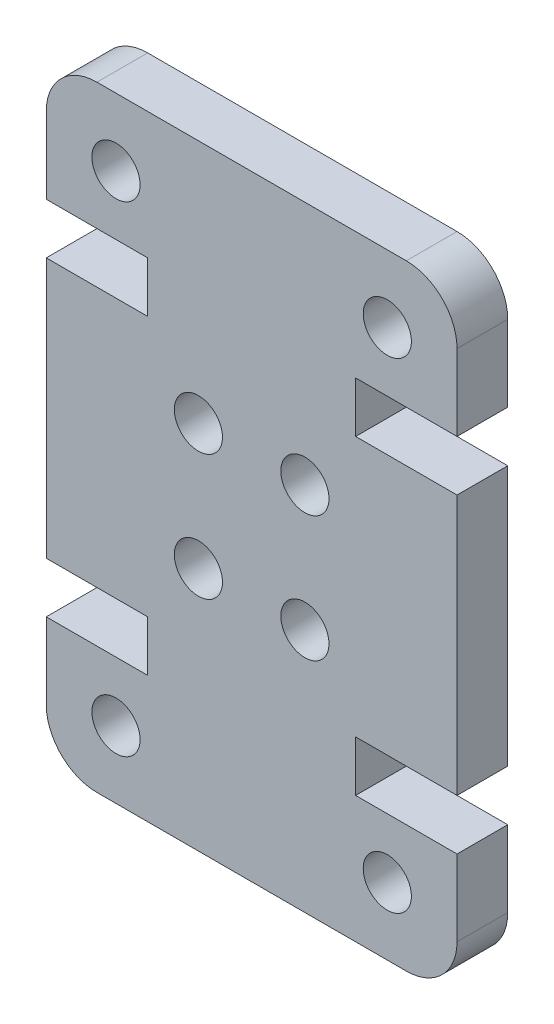
ISO-10303-21;
HEADER;
FILE_DESCRIPTION(('STEP AP214'),'2;1');
FILE_NAME('part.step','',(''),(''),'','','');
FILE_SCHEMA(('AUTOMOTIVE_DESIGN { 1 0 10303 214 1 1 1 1 }'));
ENDSEC;
DATA;
#1=APPLICATION_CONTEXT('core data for automotive mechanical design processes');
#2=APPLICATION_PROTOCOL_DEFINITION('international standard','automotive_design',2000,#1);
#3=PRODUCT_CONTEXT('',#1,'mechanical');
#4=PRODUCT('Part','Part','',(#3));
#5=PRODUCT_RELATED_PRODUCT_CATEGORY('part','',(#4));
#6=PRODUCT_DEFINITION_FORMATION('','',#4);
#7=PRODUCT_DEFINITION_CONTEXT('part definition',#1,'design');
#8=PRODUCT_DEFINITION('design','',#6,#7);
#9=PRODUCT_DEFINITION_SHAPE('','',#8);
#10=(LENGTH_UNIT() NAMED_UNIT(*) SI_UNIT(.MILLI.,.METRE.));
#11=(NAMED_UNIT(*) PLANE_ANGLE_UNIT() SI_UNIT($,.RADIAN.));
#12=(NAMED_UNIT(*) SI_UNIT($,.STERADIAN.) SOLID_ANGLE_UNIT());
#13=UNCERTAINTY_MEASURE_WITH_UNIT(LENGTH_MEASURE(1.E-05),#10,'distance_accuracy_value','');
#14=(GEOMETRIC_REPRESENTATION_CONTEXT(3) GLOBAL_UNCERTAINTY_ASSIGNED_CONTEXT((#13)) GLOBAL_UNIT_ASSIGNED_CONTEXT((#10,
#11,#12)) REPRESENTATION_CONTEXT('',''));
#15=CARTESIAN_POINT('',(0.,0.,0.));
#16=DIRECTION('',(0.,0.,1.));
#17=DIRECTION('',(1.,0.,0.));
#18=AXIS2_PLACEMENT_3D('',#15,#16,#17);
#19=CARTESIAN_POINT('',(14.2,2.,2.));
#20=DIRECTION('',(0.,0.,-1.));
#21=DIRECTION('',(-1.,0.,0.));
#22=AXIS2_PLACEMENT_3D('',#19,#20,#21);
#23=PLANE('',#22);
#24=CARTESIAN_POINT('',(6.00000000000001,9.65355116894447,2.));
#25=DIRECTION('',(0.,0.,1.));
#26=DIRECTION('',(1.,0.,0.));
#27=AXIS2_PLACEMENT_3D('',#24,#25,#26);
#28=CIRCLE('',#27,0.95);
#29=CARTESIAN_POINT('',(6.95,9.65355116894447,2.));
#30=VERTEX_POINT('',#29);
#31=EDGE_CURVE('E464',#30,#30,#28,.T.);
#32=ORIENTED_EDGE('',*,*,#31,.F.);
#33=EDGE_LOOP('',(#32));
#34=FACE_BOUND('',#33,.T.);
#35=CARTESIAN_POINT('',(10.2,14.6064488310555,2.));
#36=DIRECTION('',(0.,0.,1.));
#37=DIRECTION('',(1.,0.,0.));
#38=AXIS2_PLACEMENT_3D('',#35,#36,#37);
#39=CIRCLE('',#38,0.949999999999999);
#40=CARTESIAN_POINT('',(11.15,14.6064488310555,2.));
#41=VERTEX_POINT('',#40);
#42=EDGE_CURVE('E476',#41,#41,#39,.T.);
#43=ORIENTED_EDGE('',*,*,#42,.F.);
#44=EDGE_LOOP('',(#43));
#45=FACE_BOUND('',#44,.T.);
#46=CARTESIAN_POINT('',(2.75000000000003,21.606448831055,2.));
#47=DIRECTION('',(0.,0.,1.));
#48=DIRECTION('',(-1.,0.,0.));
#49=AXIS2_PLACEMENT_3D('',#46,#47,#48);
#50=CIRCLE('',#49,0.95);
#51=CARTESIAN_POINT('',(1.80000000000003,21.606448831055,2.));
#52=VERTEX_POINT('',#51);
#53=EDGE_CURVE('E488',#52,#52,#50,.T.);
#54=ORIENTED_EDGE('',*,*,#53,.F.);
#55=EDGE_LOOP('',(#54));
#56=FACE_BOUND('',#55,.T.);
#57=CARTESIAN_POINT('',(13.45,2.65355116894501,2.));
#58=DIRECTION('',(0.,0.,1.));
#59=DIRECTION('',(-1.,0.,0.));
#60=AXIS2_PLACEMENT_3D('',#57,#58,#59);
#61=CIRCLE('',#60,0.949999999999999);
#62=CARTESIAN_POINT('',(12.5,2.65355116894501,2.));
#63=VERTEX_POINT('',#62);
#64=EDGE_CURVE('E230',#63,#63,#61,.T.);
#65=ORIENTED_EDGE('',*,*,#64,.F.);
#66=EDGE_LOOP('',(#65));
#67=FACE_BOUND('',#66,.T.);
#68=CARTESIAN_POINT('',(14.2,2.,2.));
#69=DIRECTION('',(0.,0.,1.));
#70=DIRECTION('',(-1.,0.,0.));
#71=AXIS2_PLACEMENT_3D('',#68,#69,#70);
#72=CIRCLE('',#71,2.);
#73=CARTESIAN_POINT('',(14.2,0.,2.));
#74=VERTEX_POINT('',#73);
#75=CARTESIAN_POINT('',(16.2,2.,2.));
#76=VERTEX_POINT('',#75);
#77=EDGE_CURVE('E273',#74,#76,#72,.T.);
#78=ORIENTED_EDGE('',*,*,#77,.T.);
#79=DIRECTION('',(0.,1.,0.));
#80=VECTOR('',#79,1.);
#81=CARTESIAN_POINT('',(16.2,2.,2.));
#82=LINE('',#81,#80);
#83=CARTESIAN_POINT('',(16.2,4.99999999999945,2.));
#84=VERTEX_POINT('',#83);
#85=EDGE_CURVE('E141',#76,#84,#82,.T.);
#86=ORIENTED_EDGE('',*,*,#85,.T.);
#87=DIRECTION('',(-1.,0.,0.));
#88=VECTOR('',#87,1.);
#89=CARTESIAN_POINT('',(12.2,4.99999999999945,2.));
#90=LINE('',#89,#88);
#91=CARTESIAN_POINT('',(12.2,4.99999999999945,2.));
#92=VERTEX_POINT('',#91);
#93=EDGE_CURVE('E336',#84,#92,#90,.T.);
#94=ORIENTED_EDGE('',*,*,#93,.T.);
#95=DIRECTION('',(0.,1.,0.));
#96=VECTOR('',#95,1.);
#97=CARTESIAN_POINT('',(12.2,6.99999999999945,2.));
#98=LINE('',#97,#96);
#99=CARTESIAN_POINT('',(12.2,6.99999999999945,2.));
#100=VERTEX_POINT('',#99);
#101=EDGE_CURVE('E355',#92,#100,#98,.T.);
#102=ORIENTED_EDGE('',*,*,#101,.T.);
#103=DIRECTION('',(1.,0.,0.));
#104=VECTOR('',#103,1.);
#105=CARTESIAN_POINT('',(16.2,6.99999999999945,2.));
#106=LINE('',#105,#104);
#107=CARTESIAN_POINT('',(16.2,6.99999999999945,2.));
#108=VERTEX_POINT('',#107);
#109=EDGE_CURVE('E352',#100,#108,#106,.T.);
#110=ORIENTED_EDGE('',*,*,#109,.T.);
#111=DIRECTION('',(0.,1.,0.));
#112=VECTOR('',#111,1.);
#113=CARTESIAN_POINT('',(16.2,17.2600000000005,2.));
#114=LINE('',#113,#112);
#115=CARTESIAN_POINT('',(16.2,17.2600000000005,2.));
#116=VERTEX_POINT('',#115);
#117=EDGE_CURVE('E354',#108,#116,#114,.T.);
#118=ORIENTED_EDGE('',*,*,#117,.T.);
#119=DIRECTION('',(-1.,0.,0.));
#120=VECTOR('',#119,1.);
#121=CARTESIAN_POINT('',(16.2,17.2600000000005,2.));
#122=LINE('',#121,#120);
#123=CARTESIAN_POINT('',(12.2,17.2600000000005,2.));
#124=VERTEX_POINT('',#123);
#125=EDGE_CURVE('E357',#116,#124,#122,.T.);
#126=ORIENTED_EDGE('',*,*,#125,.T.);
#127=DIRECTION('',(0.,1.,0.));
#128=VECTOR('',#127,1.);
#129=CARTESIAN_POINT('',(12.2,17.2600000000005,2.));
#130=LINE('',#129,#128);
#131=CARTESIAN_POINT('',(12.2,19.2600000000005,2.));
#132=VERTEX_POINT('',#131);
#133=EDGE_CURVE('E363',#124,#132,#130,.T.);
#134=ORIENTED_EDGE('',*,*,#133,.T.);
#135=DIRECTION('',(1.,0.,0.));
#136=VECTOR('',#135,1.);
#137=CARTESIAN_POINT('',(12.2,19.2600000000005,2.));
#138=LINE('',#137,#136);
#139=CARTESIAN_POINT('',(16.2,19.2600000000005,2.));
#140=VERTEX_POINT('',#139);
#141=EDGE_CURVE('E365',#132,#140,#138,.T.);
#142=ORIENTED_EDGE('',*,*,#141,.T.);
#143=DIRECTION('',(0.,1.,0.));
#144=VECTOR('',#143,1.);
#145=CARTESIAN_POINT('',(16.2,22.26,2.));
#146=LINE('',#145,#144);
#147=CARTESIAN_POINT('',(16.2,22.26,2.));
#148=VERTEX_POINT('',#147);
#149=EDGE_CURVE('E367',#140,#148,#146,.T.);
#150=ORIENTED_EDGE('',*,*,#149,.T.);
#151=CARTESIAN_POINT('',(14.2,22.26,2.));
#152=DIRECTION('',(0.,0.,1.));
#153=DIRECTION('',(1.,0.,0.));
#154=AXIS2_PLACEMENT_3D('',#151,#152,#153);
#155=CIRCLE('',#154,2.);
#156=CARTESIAN_POINT('',(14.2,24.26,2.));
#157=VERTEX_POINT('',#156);
#158=EDGE_CURVE('E369',#148,#157,#155,.T.);
#159=ORIENTED_EDGE('',*,*,#158,.T.);
#160=DIRECTION('',(-1.,0.,0.));
#161=VECTOR('',#160,1.);
#162=CARTESIAN_POINT('',(1.99999999999999,24.26,2.));
#163=LINE('',#162,#161);
#164=CARTESIAN_POINT('',(1.99999999999999,24.26,2.));
#165=VERTEX_POINT('',#164);
#166=EDGE_CURVE('E371',#157,#165,#163,.T.);
#167=ORIENTED_EDGE('',*,*,#166,.T.);
#168=CARTESIAN_POINT('',(2.,22.26,2.));
#169=DIRECTION('',(0.,0.,1.));
#170=DIRECTION('',(-1.,0.,0.));
#171=AXIS2_PLACEMENT_3D('',#168,#169,#170);
#172=CIRCLE('',#171,2.);
#173=CARTESIAN_POINT('',(0.,22.26,2.));
#174=VERTEX_POINT('',#173);
#175=EDGE_CURVE('E373',#165,#174,#172,.T.);
#176=ORIENTED_EDGE('',*,*,#175,.T.);
#177=DIRECTION('',(0.,-1.,0.));
#178=VECTOR('',#177,1.);
#179=CARTESIAN_POINT('',(0.,22.26,2.));
#180=LINE('',#179,#178);
#181=CARTESIAN_POINT('',(0.,19.2600000000005,2.));
#182=VERTEX_POINT('',#181);
#183=EDGE_CURVE('E375',#174,#182,#180,.T.);
#184=ORIENTED_EDGE('',*,*,#183,.T.);
#185=DIRECTION('',(1.,0.,0.));
#186=VECTOR('',#185,1.);
#187=CARTESIAN_POINT('',(3.99999999999999,19.2600000000005,2.));
#188=LINE('',#187,#186);
#189=CARTESIAN_POINT('',(3.99999999999999,19.2600000000005,2.));
#190=VERTEX_POINT('',#189);
#191=EDGE_CURVE('E377',#182,#190,#188,.T.);
#192=ORIENTED_EDGE('',*,*,#191,.T.);
#193=DIRECTION('',(0.,-1.,0.));
#194=VECTOR('',#193,1.);
#195=CARTESIAN_POINT('',(3.99999999999999,17.2600000000005,2.));
#196=LINE('',#195,#194);
#197=CARTESIAN_POINT('',(3.99999999999999,17.2600000000005,2.));
#198=VERTEX_POINT('',#197);
#199=EDGE_CURVE('E379',#190,#198,#196,.T.);
#200=ORIENTED_EDGE('',*,*,#199,.T.);
#201=DIRECTION('',(-1.,0.,0.));
#202=VECTOR('',#201,1.);
#203=CARTESIAN_POINT('',(0.,17.2600000000005,2.));
#204=LINE('',#203,#202);
#205=CARTESIAN_POINT('',(0.,17.2600000000005,2.));
#206=VERTEX_POINT('',#205);
#207=EDGE_CURVE('E381',#198,#206,#204,.T.);
#208=ORIENTED_EDGE('',*,*,#207,.T.);
#209=DIRECTION('',(0.,-1.,0.));
#210=VECTOR('',#209,1.);
#211=CARTESIAN_POINT('',(0.,17.2600000000005,2.));
#212=LINE('',#211,#210);
#213=CARTESIAN_POINT('',(0.,6.99999999999945,2.));
#214=VERTEX_POINT('',#213);
#215=EDGE_CURVE('E383',#206,#214,#212,.T.);
#216=ORIENTED_EDGE('',*,*,#215,.T.);
#217=DIRECTION('',(1.,0.,0.));
#218=VECTOR('',#217,1.);
#219=CARTESIAN_POINT('',(0.,6.99999999999945,2.));
#220=LINE('',#219,#218);
#221=CARTESIAN_POINT('',(4.,6.99999999999945,2.));
#222=VERTEX_POINT('',#221);
#223=EDGE_CURVE('E385',#214,#222,#220,.T.);
#224=ORIENTED_EDGE('',*,*,#223,.T.);
#225=DIRECTION('',(0.,-1.,0.));
#226=VECTOR('',#225,1.);
#227=CARTESIAN_POINT('',(4.,6.99999999999945,2.));
#228=LINE('',#227,#226);
#229=CARTESIAN_POINT('',(4.,4.99999999999945,2.));
#230=VERTEX_POINT('',#229);
#231=EDGE_CURVE('E387',#222,#230,#228,.T.);
#232=ORIENTED_EDGE('',*,*,#231,.T.);
#233=DIRECTION('',(-1.,0.,0.));
#234=VECTOR('',#233,1.);
#235=CARTESIAN_POINT('',(4.,4.99999999999945,2.));
#236=LINE('',#235,#234);
#237=CARTESIAN_POINT('',(0.,4.99999999999945,2.));
#238=VERTEX_POINT('',#237);
#239=EDGE_CURVE('E208',#230,#238,#236,.T.);
#240=ORIENTED_EDGE('',*,*,#239,.T.);
#241=DIRECTION('',(0.,-1.,0.));
#242=VECTOR('',#241,1.);
#243=CARTESIAN_POINT('',(0.,2.,2.));
#244=LINE('',#243,#242);
#245=CARTESIAN_POINT('',(0.,2.,2.));
#246=VERTEX_POINT('',#245);
#247=EDGE_CURVE('E202',#238,#246,#244,.T.);
#248=ORIENTED_EDGE('',*,*,#247,.T.);
#249=CARTESIAN_POINT('',(2.,2.,2.));
#250=DIRECTION('',(0.,0.,1.));
#251=DIRECTION('',(1.,0.,0.));
#252=AXIS2_PLACEMENT_3D('',#249,#250,#251);
#253=CIRCLE('',#252,2.);
#254=CARTESIAN_POINT('',(2.,0.,2.));
#255=VERTEX_POINT('',#254);
#256=EDGE_CURVE('E206',#246,#255,#253,.T.);
#257=ORIENTED_EDGE('',*,*,#256,.T.);
#258=DIRECTION('',(1.,0.,0.));
#259=VECTOR('',#258,1.);
#260=CARTESIAN_POINT('',(2.,0.,2.));
#261=LINE('',#260,#259);
#262=EDGE_CURVE('E50',#255,#74,#261,.T.);
#263=ORIENTED_EDGE('',*,*,#262,.T.);
#264=EDGE_LOOP('',(#78,#86,#94,#102,#110,#118,#126,#134,#142,#150,#159,#167,#176,#184,#192,#200,
#208,#216,#224,#232,#240,#248,#257,#263));
#265=FACE_BOUND('',#264,.T.);
#266=CARTESIAN_POINT('',(10.2,9.65355116894447,2.));
#267=DIRECTION('',(0.,0.,1.));
#268=DIRECTION('',(-1.,0.,0.));
#269=AXIS2_PLACEMENT_3D('',#266,#267,#268);
#270=CIRCLE('',#269,0.949999999999999);
#271=CARTESIAN_POINT('',(9.24999999999999,9.65355116894447,2.));
#272=VERTEX_POINT('',#271);
#273=EDGE_CURVE('E494',#272,#272,#270,.T.);
#274=ORIENTED_EDGE('',*,*,#273,.F.);
#275=EDGE_LOOP('',(#274));
#276=FACE_BOUND('',#275,.T.);
#277=CARTESIAN_POINT('',(6.,14.6064488310555,2.));
#278=DIRECTION('',(0.,0.,1.));
#279=DIRECTION('',(-1.,0.,0.));
#280=AXIS2_PLACEMENT_3D('',#277,#278,#279);
#281=CIRCLE('',#280,0.949999999999999);
#282=CARTESIAN_POINT('',(5.05,14.6064488310555,2.));
#283=VERTEX_POINT('',#282);
#284=EDGE_CURVE('E482',#283,#283,#281,.T.);
#285=ORIENTED_EDGE('',*,*,#284,.F.);
#286=EDGE_LOOP('',(#285));
#287=FACE_BOUND('',#286,.T.);
#288=CARTESIAN_POINT('',(13.45,21.606448831055,2.));
#289=DIRECTION('',(0.,0.,1.));
#290=DIRECTION('',(1.,0.,0.));
#291=AXIS2_PLACEMENT_3D('',#288,#289,#290);
#292=CIRCLE('',#291,0.949999999999999);
#293=CARTESIAN_POINT('',(14.4,21.606448831055,2.));
#294=VERTEX_POINT('',#293);
#295=EDGE_CURVE('E470',#294,#294,#292,.T.);
#296=ORIENTED_EDGE('',*,*,#295,.F.);
#297=EDGE_LOOP('',(#296));
#298=FACE_BOUND('',#297,.T.);
#299=CARTESIAN_POINT('',(2.75000000000003,2.65355116894501,2.));
#300=DIRECTION('',(0.,0.,1.));
#301=DIRECTION('',(1.,0.,0.));
#302=AXIS2_PLACEMENT_3D('',#299,#300,#301);
#303=CIRCLE('',#302,0.95);
#304=CARTESIAN_POINT('',(3.70000000000003,2.65355116894501,2.));
#305=VERTEX_POINT('',#304);
#306=EDGE_CURVE('E455',#305,#305,#303,.T.);
#307=ORIENTED_EDGE('',*,*,#306,.F.);
#308=EDGE_LOOP('',(#307));
#309=FACE_BOUND('',#308,.T.);
#310=ADVANCED_FACE('F33',(#34,#45,#56,#67,#265,#276,#287,#298,#309),#23,.F.);
#311=CARTESIAN_POINT('',(14.2,2.,0.));
#312=DIRECTION('',(0.,0.,-1.));
#313=DIRECTION('',(-1.,0.,0.));
#314=AXIS2_PLACEMENT_3D('',#311,#312,#313);
#315=PLANE('',#314);
#316=CARTESIAN_POINT('',(6.00000000000001,9.65355116894447,0.));
#317=DIRECTION('',(0.,0.,1.));
#318=DIRECTION('',(1.,0.,0.));
#319=AXIS2_PLACEMENT_3D('',#316,#317,#318);
#320=CIRCLE('',#319,0.95);
#321=CARTESIAN_POINT('',(6.95,9.65355116894447,0.));
#322=VERTEX_POINT('',#321);
#323=EDGE_CURVE('E461',#322,#322,#320,.T.);
#324=ORIENTED_EDGE('',*,*,#323,.T.);
#325=EDGE_LOOP('',(#324));
#326=FACE_BOUND('',#325,.T.);
#327=CARTESIAN_POINT('',(10.2,14.6064488310555,0.));
#328=DIRECTION('',(0.,0.,1.));
#329=DIRECTION('',(1.,0.,0.));
#330=AXIS2_PLACEMENT_3D('',#327,#328,#329);
#331=CIRCLE('',#330,0.949999999999999);
#332=CARTESIAN_POINT('',(11.15,14.6064488310555,0.));
#333=VERTEX_POINT('',#332);
#334=EDGE_CURVE('E473',#333,#333,#331,.T.);
#335=ORIENTED_EDGE('',*,*,#334,.T.);
#336=EDGE_LOOP('',(#335));
#337=FACE_BOUND('',#336,.T.);
#338=CARTESIAN_POINT('',(2.75000000000003,21.606448831055,0.));
#339=DIRECTION('',(0.,0.,1.));
#340=DIRECTION('',(-1.,0.,0.));
#341=AXIS2_PLACEMENT_3D('',#338,#339,#340);
#342=CIRCLE('',#341,0.95);
#343=CARTESIAN_POINT('',(1.80000000000003,21.606448831055,0.));
#344=VERTEX_POINT('',#343);
#345=EDGE_CURVE('E485',#344,#344,#342,.T.);
#346=ORIENTED_EDGE('',*,*,#345,.T.);
#347=EDGE_LOOP('',(#346));
#348=FACE_BOUND('',#347,.T.);
#349=CARTESIAN_POINT('',(13.45,2.65355116894501,0.));
#350=DIRECTION('',(0.,0.,1.));
#351=DIRECTION('',(-1.,0.,0.));
#352=AXIS2_PLACEMENT_3D('',#349,#350,#351);
#353=CIRCLE('',#352,0.949999999999999);
#354=CARTESIAN_POINT('',(12.5,2.65355116894501,0.));
#355=VERTEX_POINT('',#354);
#356=EDGE_CURVE('E497',#355,#355,#353,.T.);
#357=ORIENTED_EDGE('',*,*,#356,.T.);
#358=EDGE_LOOP('',(#357));
#359=FACE_BOUND('',#358,.T.);
#360=CARTESIAN_POINT('',(14.2,2.,0.));
#361=DIRECTION('',(0.,0.,1.));
#362=DIRECTION('',(-1.,0.,0.));
#363=AXIS2_PLACEMENT_3D('',#360,#361,#362);
#364=CIRCLE('',#363,2.);
#365=CARTESIAN_POINT('',(14.2,0.,0.));
#366=VERTEX_POINT('',#365);
#367=CARTESIAN_POINT('',(16.2,2.,0.));
#368=VERTEX_POINT('',#367);
#369=EDGE_CURVE('E226',#366,#368,#364,.T.);
#370=ORIENTED_EDGE('',*,*,#369,.F.);
#371=DIRECTION('',(1.,0.,0.));
#372=VECTOR('',#371,1.);
#373=CARTESIAN_POINT('',(2.,0.,0.));
#374=LINE('',#373,#372);
#375=CARTESIAN_POINT('',(2.,0.,0.));
#376=VERTEX_POINT('',#375);
#377=EDGE_CURVE('E133',#376,#366,#374,.T.);
#378=ORIENTED_EDGE('',*,*,#377,.F.);
#379=CARTESIAN_POINT('',(2.,2.,0.));
#380=DIRECTION('',(0.,0.,1.));
#381=DIRECTION('',(1.,0.,0.));
#382=AXIS2_PLACEMENT_3D('',#379,#380,#381);
#383=CIRCLE('',#382,2.);
#384=CARTESIAN_POINT('',(0.,2.,0.));
#385=VERTEX_POINT('',#384);
#386=EDGE_CURVE('E127',#385,#376,#383,.T.);
#387=ORIENTED_EDGE('',*,*,#386,.F.);
#388=DIRECTION('',(0.,-1.,0.));
#389=VECTOR('',#388,1.);
#390=CARTESIAN_POINT('',(0.,2.,0.));
#391=LINE('',#390,#389);
#392=CARTESIAN_POINT('',(0.,4.99999999999945,0.));
#393=VERTEX_POINT('',#392);
#394=EDGE_CURVE('E216',#393,#385,#391,.T.);
#395=ORIENTED_EDGE('',*,*,#394,.F.);
#396=DIRECTION('',(-1.,0.,0.));
#397=VECTOR('',#396,1.);
#398=CARTESIAN_POINT('',(4.,4.99999999999945,0.));
#399=LINE('',#398,#397);
#400=CARTESIAN_POINT('',(4.,4.99999999999945,0.));
#401=VERTEX_POINT('',#400);
#402=EDGE_CURVE('E268',#401,#393,#399,.T.);
#403=ORIENTED_EDGE('',*,*,#402,.F.);
#404=DIRECTION('',(0.,-1.,0.));
#405=VECTOR('',#404,1.);
#406=CARTESIAN_POINT('',(4.,6.99999999999945,0.));
#407=LINE('',#406,#405);
#408=CARTESIAN_POINT('',(4.,6.99999999999945,0.));
#409=VERTEX_POINT('',#408);
#410=EDGE_CURVE('E266',#409,#401,#407,.T.);
#411=ORIENTED_EDGE('',*,*,#410,.F.);
#412=DIRECTION('',(1.,0.,0.));
#413=VECTOR('',#412,1.);
#414=CARTESIAN_POINT('',(0.,6.99999999999945,0.));
#415=LINE('',#414,#413);
#416=CARTESIAN_POINT('',(0.,6.99999999999945,0.));
#417=VERTEX_POINT('',#416);
#418=EDGE_CURVE('E264',#417,#409,#415,.T.);
#419=ORIENTED_EDGE('',*,*,#418,.F.);
#420=DIRECTION('',(0.,-1.,0.));
#421=VECTOR('',#420,1.);
#422=CARTESIAN_POINT('',(0.,17.2600000000005,0.));
#423=LINE('',#422,#421);
#424=CARTESIAN_POINT('',(0.,17.2600000000005,0.));
#425=VERTEX_POINT('',#424);
#426=EDGE_CURVE('E262',#425,#417,#423,.T.);
#427=ORIENTED_EDGE('',*,*,#426,.F.);
#428=DIRECTION('',(-1.,0.,0.));
#429=VECTOR('',#428,1.);
#430=CARTESIAN_POINT('',(0.,17.2600000000005,0.));
#431=LINE('',#430,#429);
#432=CARTESIAN_POINT('',(3.99999999999999,17.2600000000005,0.));
#433=VERTEX_POINT('',#432);
#434=EDGE_CURVE('E260',#433,#425,#431,.T.);
#435=ORIENTED_EDGE('',*,*,#434,.F.);
#436=DIRECTION('',(0.,-1.,0.));
#437=VECTOR('',#436,1.);
#438=CARTESIAN_POINT('',(3.99999999999999,17.2600000000005,0.));
#439=LINE('',#438,#437);
#440=CARTESIAN_POINT('',(3.99999999999999,19.2600000000005,0.));
#441=VERTEX_POINT('',#440);
#442=EDGE_CURVE('E258',#441,#433,#439,.T.);
#443=ORIENTED_EDGE('',*,*,#442,.F.);
#444=DIRECTION('',(1.,0.,0.));
#445=VECTOR('',#444,1.);
#446=CARTESIAN_POINT('',(3.99999999999999,19.2600000000005,0.));
#447=LINE('',#446,#445);
#448=CARTESIAN_POINT('',(0.,19.2600000000005,0.));
#449=VERTEX_POINT('',#448);
#450=EDGE_CURVE('E256',#449,#441,#447,.T.);
#451=ORIENTED_EDGE('',*,*,#450,.F.);
#452=DIRECTION('',(0.,-1.,0.));
#453=VECTOR('',#452,1.);
#454=CARTESIAN_POINT('',(0.,22.26,0.));
#455=LINE('',#454,#453);
#456=CARTESIAN_POINT('',(0.,22.26,0.));
#457=VERTEX_POINT('',#456);
#458=EDGE_CURVE('E254',#457,#449,#455,.T.);
#459=ORIENTED_EDGE('',*,*,#458,.F.);
#460=CARTESIAN_POINT('',(2.,22.26,0.));
#461=DIRECTION('',(0.,0.,1.));
#462=DIRECTION('',(-1.,0.,0.));
#463=AXIS2_PLACEMENT_3D('',#460,#461,#462);
#464=CIRCLE('',#463,2.);
#465=CARTESIAN_POINT('',(1.99999999999999,24.26,0.));
#466=VERTEX_POINT('',#465);
#467=EDGE_CURVE('E252',#466,#457,#464,.T.);
#468=ORIENTED_EDGE('',*,*,#467,.F.);
#469=DIRECTION('',(-1.,0.,0.));
#470=VECTOR('',#469,1.);
#471=CARTESIAN_POINT('',(1.99999999999999,24.26,0.));
#472=LINE('',#471,#470);
#473=CARTESIAN_POINT('',(14.2,24.26,0.));
#474=VERTEX_POINT('',#473);
#475=EDGE_CURVE('E250',#474,#466,#472,.T.);
#476=ORIENTED_EDGE('',*,*,#475,.F.);
#477=CARTESIAN_POINT('',(14.2,22.26,0.));
#478=DIRECTION('',(0.,0.,1.));
#479=DIRECTION('',(1.,0.,0.));
#480=AXIS2_PLACEMENT_3D('',#477,#478,#479);
#481=CIRCLE('',#480,2.);
#482=CARTESIAN_POINT('',(16.2,22.26,0.));
#483=VERTEX_POINT('',#482);
#484=EDGE_CURVE('E248',#483,#474,#481,.T.);
#485=ORIENTED_EDGE('',*,*,#484,.F.);
#486=DIRECTION('',(0.,1.,0.));
#487=VECTOR('',#486,1.);
#488=CARTESIAN_POINT('',(16.2,22.26,0.));
#489=LINE('',#488,#487);
#490=CARTESIAN_POINT('',(16.2,19.2600000000005,0.));
#491=VERTEX_POINT('',#490);
#492=EDGE_CURVE('E246',#491,#483,#489,.T.);
#493=ORIENTED_EDGE('',*,*,#492,.F.);
#494=DIRECTION('',(1.,0.,0.));
#495=VECTOR('',#494,1.);
#496=CARTESIAN_POINT('',(12.2,19.2600000000005,0.));
#497=LINE('',#496,#495);
#498=CARTESIAN_POINT('',(12.2,19.2600000000005,0.));
#499=VERTEX_POINT('',#498);
#500=EDGE_CURVE('E244',#499,#491,#497,.T.);
#501=ORIENTED_EDGE('',*,*,#500,.F.);
#502=DIRECTION('',(0.,1.,0.));
#503=VECTOR('',#502,1.);
#504=CARTESIAN_POINT('',(12.2,17.2600000000005,0.));
#505=LINE('',#504,#503);
#506=CARTESIAN_POINT('',(12.2,17.2600000000005,0.));
#507=VERTEX_POINT('',#506);
#508=EDGE_CURVE('E242',#507,#499,#505,.T.);
#509=ORIENTED_EDGE('',*,*,#508,.F.);
#510=DIRECTION('',(-1.,0.,0.));
#511=VECTOR('',#510,1.);
#512=CARTESIAN_POINT('',(16.2,17.2600000000005,0.));
#513=LINE('',#512,#511);
#514=CARTESIAN_POINT('',(16.2,17.2600000000005,0.));
#515=VERTEX_POINT('',#514);
#516=EDGE_CURVE('E240',#515,#507,#513,.T.);
#517=ORIENTED_EDGE('',*,*,#516,.F.);
#518=DIRECTION('',(0.,1.,0.));
#519=VECTOR('',#518,1.);
#520=CARTESIAN_POINT('',(16.2,17.2600000000005,0.));
#521=LINE('',#520,#519);
#522=CARTESIAN_POINT('',(16.2,6.99999999999945,0.));
#523=VERTEX_POINT('',#522);
#524=EDGE_CURVE('E238',#523,#515,#521,.T.);
#525=ORIENTED_EDGE('',*,*,#524,.F.);
#526=DIRECTION('',(1.,0.,0.));
#527=VECTOR('',#526,1.);
#528=CARTESIAN_POINT('',(16.2,6.99999999999945,0.));
#529=LINE('',#528,#527);
#530=CARTESIAN_POINT('',(12.2,6.99999999999945,0.));
#531=VERTEX_POINT('',#530);
#532=EDGE_CURVE('E236',#531,#523,#529,.T.);
#533=ORIENTED_EDGE('',*,*,#532,.F.);
#534=DIRECTION('',(0.,1.,0.));
#535=VECTOR('',#534,1.);
#536=CARTESIAN_POINT('',(12.2,6.99999999999945,0.));
#537=LINE('',#536,#535);
#538=CARTESIAN_POINT('',(12.2,4.99999999999945,0.));
#539=VERTEX_POINT('',#538);
#540=EDGE_CURVE('E234',#539,#531,#537,.T.);
#541=ORIENTED_EDGE('',*,*,#540,.F.);
#542=DIRECTION('',(-1.,0.,0.));
#543=VECTOR('',#542,1.);
#544=CARTESIAN_POINT('',(12.2,4.99999999999945,0.));
#545=LINE('',#544,#543);
#546=CARTESIAN_POINT('',(16.2,4.99999999999945,0.));
#547=VERTEX_POINT('',#546);
#548=EDGE_CURVE('E232',#547,#539,#545,.T.);
#549=ORIENTED_EDGE('',*,*,#548,.F.);
#550=DIRECTION('',(0.,1.,0.));
#551=VECTOR('',#550,1.);
#552=CARTESIAN_POINT('',(16.2,2.,0.));
#553=LINE('',#552,#551);
#554=EDGE_CURVE('E229',#368,#547,#553,.T.);
#555=ORIENTED_EDGE('',*,*,#554,.F.);
#556=EDGE_LOOP('',(#370,#378,#387,#395,#403,#411,#419,#427,#435,#443,#451,#459,#468,#476,#485,
#493,#501,#509,#517,#525,#533,#541,#549,#555));
#557=FACE_BOUND('',#556,.T.);
#558=CARTESIAN_POINT('',(10.2,9.65355116894447,0.));
#559=DIRECTION('',(0.,0.,1.));
#560=DIRECTION('',(-1.,0.,0.));
#561=AXIS2_PLACEMENT_3D('',#558,#559,#560);
#562=CIRCLE('',#561,0.949999999999999);
#563=CARTESIAN_POINT('',(9.24999999999999,9.65355116894447,0.));
#564=VERTEX_POINT('',#563);
#565=EDGE_CURVE('E491',#564,#564,#562,.T.);
#566=ORIENTED_EDGE('',*,*,#565,.T.);
#567=EDGE_LOOP('',(#566));
#568=FACE_BOUND('',#567,.T.);
#569=CARTESIAN_POINT('',(6.,14.6064488310555,0.));
#570=DIRECTION('',(0.,0.,1.));
#571=DIRECTION('',(-1.,0.,0.));
#572=AXIS2_PLACEMENT_3D('',#569,#570,#571);
#573=CIRCLE('',#572,0.949999999999999);
#574=CARTESIAN_POINT('',(5.05,14.6064488310555,0.));
#575=VERTEX_POINT('',#574);
#576=EDGE_CURVE('E479',#575,#575,#573,.T.);
#577=ORIENTED_EDGE('',*,*,#576,.T.);
#578=EDGE_LOOP('',(#577));
#579=FACE_BOUND('',#578,.T.);
#580=CARTESIAN_POINT('',(13.45,21.606448831055,0.));
#581=DIRECTION('',(0.,0.,1.));
#582=DIRECTION('',(1.,0.,0.));
#583=AXIS2_PLACEMENT_3D('',#580,#581,#582);
#584=CIRCLE('',#583,0.949999999999999);
#585=CARTESIAN_POINT('',(14.4,21.606448831055,0.));
#586=VERTEX_POINT('',#585);
#587=EDGE_CURVE('E467',#586,#586,#584,.T.);
#588=ORIENTED_EDGE('',*,*,#587,.T.);
#589=EDGE_LOOP('',(#588));
#590=FACE_BOUND('',#589,.T.);
#591=CARTESIAN_POINT('',(2.75000000000003,2.65355116894501,0.));
#592=DIRECTION('',(0.,0.,1.));
#593=DIRECTION('',(1.,0.,0.));
#594=AXIS2_PLACEMENT_3D('',#591,#592,#593);
#595=CIRCLE('',#594,0.95);
#596=CARTESIAN_POINT('',(3.70000000000003,2.65355116894501,0.));
#597=VERTEX_POINT('',#596);
#598=EDGE_CURVE('E458',#597,#597,#595,.T.);
#599=ORIENTED_EDGE('',*,*,#598,.T.);
#600=EDGE_LOOP('',(#599));
#601=FACE_BOUND('',#600,.T.);
#602=ADVANCED_FACE('F340',(#326,#337,#348,#359,#557,#568,#579,#590,#601),#315,.T.);
#603=CARTESIAN_POINT('',(14.2,2.,2.));
#604=DIRECTION('',(0.,0.,-1.));
#605=DIRECTION('',(-1.,0.,0.));
#606=AXIS2_PLACEMENT_3D('',#603,#604,#605);
#607=CYLINDRICAL_SURFACE('',#606,2.);
#608=ORIENTED_EDGE('',*,*,#369,.T.);
#609=DIRECTION('',(0.,0.,-1.));
#610=VECTOR('',#609,1.);
#611=CARTESIAN_POINT('',(16.2,2.,2.));
#612=LINE('',#611,#610);
#613=EDGE_CURVE('E11',#76,#368,#612,.T.);
#614=ORIENTED_EDGE('',*,*,#613,.F.);
#615=ORIENTED_EDGE('',*,*,#77,.F.);
#616=DIRECTION('',(0.,0.,-1.));
#617=VECTOR('',#616,1.);
#618=CARTESIAN_POINT('',(14.2,0.,2.));
#619=LINE('',#618,#617);
#620=EDGE_CURVE('E222',#74,#366,#619,.T.);
#621=ORIENTED_EDGE('',*,*,#620,.T.);
#622=EDGE_LOOP('',(#608,#614,#615,#621));
#623=FACE_BOUND('',#622,.T.);
#624=ADVANCED_FACE('F35',(#623),#607,.T.);
#625=CARTESIAN_POINT('',(16.2,2.,2.));
#626=DIRECTION('',(-1.,0.,0.));
#627=DIRECTION('',(0.,0.,1.));
#628=AXIS2_PLACEMENT_3D('',#625,#626,#627);
#629=PLANE('',#628);
#630=ORIENTED_EDGE('',*,*,#554,.T.);
#631=DIRECTION('',(0.,0.,-1.));
#632=VECTOR('',#631,1.);
#633=CARTESIAN_POINT('',(16.2,4.99999999999945,2.));
#634=LINE('',#633,#632);
#635=EDGE_CURVE('E42',#84,#547,#634,.T.);
#636=ORIENTED_EDGE('',*,*,#635,.F.);
#637=ORIENTED_EDGE('',*,*,#85,.F.);
#638=ORIENTED_EDGE('',*,*,#613,.T.);
#639=EDGE_LOOP('',(#630,#636,#637,#638));
#640=FACE_BOUND('',#639,.T.);
#641=ADVANCED_FACE('F762',(#640),#629,.F.);
#642=CARTESIAN_POINT('',(12.2,4.99999999999945,2.));
#643=DIRECTION('',(0.,-1.,0.));
#644=DIRECTION('',(0.,0.,-1.));
#645=AXIS2_PLACEMENT_3D('',#642,#643,#644);
#646=PLANE('',#645);
#647=ORIENTED_EDGE('',*,*,#548,.T.);
#648=DIRECTION('',(0.,0.,-1.));
#649=VECTOR('',#648,1.);
#650=CARTESIAN_POINT('',(12.2,4.99999999999945,2.));
#651=LINE('',#650,#649);
#652=EDGE_CURVE('E328',#92,#539,#651,.T.);
#653=ORIENTED_EDGE('',*,*,#652,.F.);
#654=ORIENTED_EDGE('',*,*,#93,.F.);
#655=ORIENTED_EDGE('',*,*,#635,.T.);
#656=EDGE_LOOP('',(#647,#653,#654,#655));
#657=FACE_BOUND('',#656,.T.);
#658=ADVANCED_FACE('F334',(#657),#646,.F.);
#659=CARTESIAN_POINT('',(12.2,6.99999999999945,2.));
#660=DIRECTION('',(-1.,0.,0.));
#661=DIRECTION('',(0.,0.,1.));
#662=AXIS2_PLACEMENT_3D('',#659,#660,#661);
#663=PLANE('',#662);
#664=ORIENTED_EDGE('',*,*,#540,.T.);
#665=DIRECTION('',(0.,0.,-1.));
#666=VECTOR('',#665,1.);
#667=CARTESIAN_POINT('',(12.2,6.99999999999945,2.));
#668=LINE('',#667,#666);
#669=EDGE_CURVE('E325',#100,#531,#668,.T.);
#670=ORIENTED_EDGE('',*,*,#669,.F.);
#671=ORIENTED_EDGE('',*,*,#101,.F.);
#672=ORIENTED_EDGE('',*,*,#652,.T.);
#673=EDGE_LOOP('',(#664,#670,#671,#672));
#674=FACE_BOUND('',#673,.T.);
#675=ADVANCED_FACE('F346',(#674),#663,.F.);
#676=CARTESIAN_POINT('',(16.2,6.99999999999945,2.));
#677=DIRECTION('',(0.,1.,0.));
#678=DIRECTION('',(-1.,0.,0.));
#679=AXIS2_PLACEMENT_3D('',#676,#677,#678);
#680=PLANE('',#679);
#681=ORIENTED_EDGE('',*,*,#532,.T.);
#682=DIRECTION('',(0.,0.,-1.));
#683=VECTOR('',#682,1.);
#684=CARTESIAN_POINT('',(16.2,6.99999999999945,2.));
#685=LINE('',#684,#683);
#686=EDGE_CURVE('E322',#108,#523,#685,.T.);
#687=ORIENTED_EDGE('',*,*,#686,.F.);
#688=ORIENTED_EDGE('',*,*,#109,.F.);
#689=ORIENTED_EDGE('',*,*,#669,.T.);
#690=EDGE_LOOP('',(#681,#687,#688,#689));
#691=FACE_BOUND('',#690,.T.);
#692=ADVANCED_FACE('F350',(#691),#680,.F.);
#693=CARTESIAN_POINT('',(16.2,17.2600000000005,2.));
#694=DIRECTION('',(-1.,0.,0.));
#695=DIRECTION('',(0.,0.,1.));
#696=AXIS2_PLACEMENT_3D('',#693,#694,#695);
#697=PLANE('',#696);
#698=ORIENTED_EDGE('',*,*,#524,.T.);
#699=DIRECTION('',(0.,0.,-1.));
#700=VECTOR('',#699,1.);
#701=CARTESIAN_POINT('',(16.2,17.2600000000005,2.));
#702=LINE('',#701,#700);
#703=EDGE_CURVE('E319',#116,#515,#702,.T.);
#704=ORIENTED_EDGE('',*,*,#703,.F.);
#705=ORIENTED_EDGE('',*,*,#117,.F.);
#706=ORIENTED_EDGE('',*,*,#686,.T.);
#707=EDGE_LOOP('',(#698,#704,#705,#706));
#708=FACE_BOUND('',#707,.T.);
#709=ADVANCED_FACE('F727',(#708),#697,.F.);
#710=CARTESIAN_POINT('',(16.2,17.2600000000005,2.));
#711=DIRECTION('',(0.,-1.,0.));
#712=DIRECTION('',(0.,0.,-1.));
#713=AXIS2_PLACEMENT_3D('',#710,#711,#712);
#714=PLANE('',#713);
#715=ORIENTED_EDGE('',*,*,#516,.T.);
#716=DIRECTION('',(0.,0.,-1.));
#717=VECTOR('',#716,1.);
#718=CARTESIAN_POINT('',(12.2,17.2600000000005,2.));
#719=LINE('',#718,#717);
#720=EDGE_CURVE('E316',#124,#507,#719,.T.);
#721=ORIENTED_EDGE('',*,*,#720,.F.);
#722=ORIENTED_EDGE('',*,*,#125,.F.);
#723=ORIENTED_EDGE('',*,*,#703,.T.);
#724=EDGE_LOOP('',(#715,#721,#722,#723));
#725=FACE_BOUND('',#724,.T.);
#726=ADVANCED_FACE('F717',(#725),#714,.F.);
#727=CARTESIAN_POINT('',(12.2,17.2600000000005,2.));
#728=DIRECTION('',(-1.,0.,0.));
#729=DIRECTION('',(0.,0.,1.));
#730=AXIS2_PLACEMENT_3D('',#727,#728,#729);
#731=PLANE('',#730);
#732=ORIENTED_EDGE('',*,*,#508,.T.);
#733=DIRECTION('',(0.,0.,-1.));
#734=VECTOR('',#733,1.);
#735=CARTESIAN_POINT('',(12.2,19.2600000000005,2.));
#736=LINE('',#735,#734);
#737=EDGE_CURVE('E313',#132,#499,#736,.T.);
#738=ORIENTED_EDGE('',*,*,#737,.F.);
#739=ORIENTED_EDGE('',*,*,#133,.F.);
#740=ORIENTED_EDGE('',*,*,#720,.T.);
#741=EDGE_LOOP('',(#732,#738,#739,#740));
#742=FACE_BOUND('',#741,.T.);
#743=ADVANCED_FACE('F707',(#742),#731,.F.);
#744=CARTESIAN_POINT('',(12.2,19.2600000000005,2.));
#745=DIRECTION('',(0.,1.,0.));
#746=DIRECTION('',(0.,0.,1.));
#747=AXIS2_PLACEMENT_3D('',#744,#745,#746);
#748=PLANE('',#747);
#749=ORIENTED_EDGE('',*,*,#500,.T.);
#750=DIRECTION('',(0.,0.,-1.));
#751=VECTOR('',#750,1.);
#752=CARTESIAN_POINT('',(16.2,19.2600000000005,2.));
#753=LINE('',#752,#751);
#754=EDGE_CURVE('E310',#140,#491,#753,.T.);
#755=ORIENTED_EDGE('',*,*,#754,.F.);
#756=ORIENTED_EDGE('',*,*,#141,.F.);
#757=ORIENTED_EDGE('',*,*,#737,.T.);
#758=EDGE_LOOP('',(#749,#755,#756,#757));
#759=FACE_BOUND('',#758,.T.);
#760=ADVANCED_FACE('F697',(#759),#748,.F.);
#761=CARTESIAN_POINT('',(16.2,22.26,2.));
#762=DIRECTION('',(-1.,0.,0.));
#763=DIRECTION('',(0.,0.,1.));
#764=AXIS2_PLACEMENT_3D('',#761,#762,#763);
#765=PLANE('',#764);
#766=ORIENTED_EDGE('',*,*,#492,.T.);
#767=DIRECTION('',(0.,0.,-1.));
#768=VECTOR('',#767,1.);
#769=CARTESIAN_POINT('',(16.2,22.26,2.));
#770=LINE('',#769,#768);
#771=EDGE_CURVE('E307',#148,#483,#770,.T.);
#772=ORIENTED_EDGE('',*,*,#771,.F.);
#773=ORIENTED_EDGE('',*,*,#149,.F.);
#774=ORIENTED_EDGE('',*,*,#754,.T.);
#775=EDGE_LOOP('',(#766,#772,#773,#774));
#776=FACE_BOUND('',#775,.T.);
#777=ADVANCED_FACE('F687',(#776),#765,.F.);
#778=CARTESIAN_POINT('',(14.2,22.26,2.));
#779=DIRECTION('',(0.,0.,-1.));
#780=DIRECTION('',(-1.,0.,0.));
#781=AXIS2_PLACEMENT_3D('',#778,#779,#780);
#782=CYLINDRICAL_SURFACE('',#781,2.);
#783=ORIENTED_EDGE('',*,*,#484,.T.);
#784=DIRECTION('',(0.,0.,-1.));
#785=VECTOR('',#784,1.);
#786=CARTESIAN_POINT('',(14.2,24.26,2.));
#787=LINE('',#786,#785);
#788=EDGE_CURVE('E304',#157,#474,#787,.T.);
#789=ORIENTED_EDGE('',*,*,#788,.F.);
#790=ORIENTED_EDGE('',*,*,#158,.F.);
#791=ORIENTED_EDGE('',*,*,#771,.T.);
#792=EDGE_LOOP('',(#783,#789,#790,#791));
#793=FACE_BOUND('',#792,.T.);
#794=ADVANCED_FACE('F677',(#793),#782,.T.);
#795=CARTESIAN_POINT('',(1.99999999999999,24.26,2.));
#796=DIRECTION('',(0.,-1.,0.));
#797=DIRECTION('',(0.,0.,-1.));
#798=AXIS2_PLACEMENT_3D('',#795,#796,#797);
#799=PLANE('',#798);
#800=ORIENTED_EDGE('',*,*,#475,.T.);
#801=DIRECTION('',(0.,0.,-1.));
#802=VECTOR('',#801,1.);
#803=CARTESIAN_POINT('',(1.99999999999999,24.26,2.));
#804=LINE('',#803,#802);
#805=EDGE_CURVE('E301',#165,#466,#804,.T.);
#806=ORIENTED_EDGE('',*,*,#805,.F.);
#807=ORIENTED_EDGE('',*,*,#166,.F.);
#808=ORIENTED_EDGE('',*,*,#788,.T.);
#809=EDGE_LOOP('',(#800,#806,#807,#808));
#810=FACE_BOUND('',#809,.T.);
#811=ADVANCED_FACE('F667',(#810),#799,.F.);
#812=CARTESIAN_POINT('',(2.,22.26,2.));
#813=DIRECTION('',(0.,0.,-1.));
#814=DIRECTION('',(-1.,0.,0.));
#815=AXIS2_PLACEMENT_3D('',#812,#813,#814);
#816=CYLINDRICAL_SURFACE('',#815,2.);
#817=ORIENTED_EDGE('',*,*,#467,.T.);
#818=DIRECTION('',(0.,0.,-1.));
#819=VECTOR('',#818,1.);
#820=CARTESIAN_POINT('',(0.,22.26,2.));
#821=LINE('',#820,#819);
#822=EDGE_CURVE('E298',#174,#457,#821,.T.);
#823=ORIENTED_EDGE('',*,*,#822,.F.);
#824=ORIENTED_EDGE('',*,*,#175,.F.);
#825=ORIENTED_EDGE('',*,*,#805,.T.);
#826=EDGE_LOOP('',(#817,#823,#824,#825));
#827=FACE_BOUND('',#826,.T.);
#828=ADVANCED_FACE('F657',(#827),#816,.T.);
#829=CARTESIAN_POINT('',(0.,22.26,2.));
#830=DIRECTION('',(1.,0.,0.));
#831=DIRECTION('',(0.,1.,0.));
#832=AXIS2_PLACEMENT_3D('',#829,#830,#831);
#833=PLANE('',#832);
#834=ORIENTED_EDGE('',*,*,#458,.T.);
#835=DIRECTION('',(0.,0.,-1.));
#836=VECTOR('',#835,1.);
#837=CARTESIAN_POINT('',(0.,19.2600000000005,2.));
#838=LINE('',#837,#836);
#839=EDGE_CURVE('E295',#182,#449,#838,.T.);
#840=ORIENTED_EDGE('',*,*,#839,.F.);
#841=ORIENTED_EDGE('',*,*,#183,.F.);
#842=ORIENTED_EDGE('',*,*,#822,.T.);
#843=EDGE_LOOP('',(#834,#840,#841,#842));
#844=FACE_BOUND('',#843,.T.);
#845=ADVANCED_FACE('F647',(#844),#833,.F.);
#846=CARTESIAN_POINT('',(3.99999999999999,19.2600000000005,2.));
#847=DIRECTION('',(0.,1.,0.));
#848=DIRECTION('',(-1.,0.,0.));
#849=AXIS2_PLACEMENT_3D('',#846,#847,#848);
#850=PLANE('',#849);
#851=ORIENTED_EDGE('',*,*,#450,.T.);
#852=DIRECTION('',(0.,0.,-1.));
#853=VECTOR('',#852,1.);
#854=CARTESIAN_POINT('',(3.99999999999999,19.2600000000005,2.));
#855=LINE('',#854,#853);
#856=EDGE_CURVE('E292',#190,#441,#855,.T.);
#857=ORIENTED_EDGE('',*,*,#856,.F.);
#858=ORIENTED_EDGE('',*,*,#191,.F.);
#859=ORIENTED_EDGE('',*,*,#839,.T.);
#860=EDGE_LOOP('',(#851,#857,#858,#859));
#861=FACE_BOUND('',#860,.T.);
#862=ADVANCED_FACE('F637',(#861),#850,.F.);
#863=CARTESIAN_POINT('',(3.99999999999999,17.2600000000005,2.));
#864=DIRECTION('',(1.,0.,0.));
#865=DIRECTION('',(0.,0.,-1.));
#866=AXIS2_PLACEMENT_3D('',#863,#864,#865);
#867=PLANE('',#866);
#868=ORIENTED_EDGE('',*,*,#442,.T.);
#869=DIRECTION('',(0.,0.,-1.));
#870=VECTOR('',#869,1.);
#871=CARTESIAN_POINT('',(3.99999999999999,17.2600000000005,2.));
#872=LINE('',#871,#870);
#873=EDGE_CURVE('E289',#198,#433,#872,.T.);
#874=ORIENTED_EDGE('',*,*,#873,.F.);
#875=ORIENTED_EDGE('',*,*,#199,.F.);
#876=ORIENTED_EDGE('',*,*,#856,.T.);
#877=EDGE_LOOP('',(#868,#874,#875,#876));
#878=FACE_BOUND('',#877,.T.);
#879=ADVANCED_FACE('F627',(#878),#867,.F.);
#880=CARTESIAN_POINT('',(0.,17.2600000000005,2.));
#881=DIRECTION('',(0.,-1.,0.));
#882=DIRECTION('',(1.,0.,0.));
#883=AXIS2_PLACEMENT_3D('',#880,#881,#882);
#884=PLANE('',#883);
#885=ORIENTED_EDGE('',*,*,#434,.T.);
#886=DIRECTION('',(0.,0.,-1.));
#887=VECTOR('',#886,1.);
#888=CARTESIAN_POINT('',(0.,17.2600000000005,2.));
#889=LINE('',#888,#887);
#890=EDGE_CURVE('E286',#206,#425,#889,.T.);
#891=ORIENTED_EDGE('',*,*,#890,.F.);
#892=ORIENTED_EDGE('',*,*,#207,.F.);
#893=ORIENTED_EDGE('',*,*,#873,.T.);
#894=EDGE_LOOP('',(#885,#891,#892,#893));
#895=FACE_BOUND('',#894,.T.);
#896=ADVANCED_FACE('F617',(#895),#884,.F.);
#897=CARTESIAN_POINT('',(0.,17.2600000000005,2.));
#898=DIRECTION('',(1.,0.,0.));
#899=DIRECTION('',(0.,1.,0.));
#900=AXIS2_PLACEMENT_3D('',#897,#898,#899);
#901=PLANE('',#900);
#902=ORIENTED_EDGE('',*,*,#426,.T.);
#903=DIRECTION('',(0.,0.,-1.));
#904=VECTOR('',#903,1.);
#905=CARTESIAN_POINT('',(0.,6.99999999999945,2.));
#906=LINE('',#905,#904);
#907=EDGE_CURVE('E283',#214,#417,#906,.T.);
#908=ORIENTED_EDGE('',*,*,#907,.F.);
#909=ORIENTED_EDGE('',*,*,#215,.F.);
#910=ORIENTED_EDGE('',*,*,#890,.T.);
#911=EDGE_LOOP('',(#902,#908,#909,#910));
#912=FACE_BOUND('',#911,.T.);
#913=ADVANCED_FACE('F607',(#912),#901,.F.);
#914=CARTESIAN_POINT('',(0.,6.99999999999945,2.));
#915=DIRECTION('',(0.,1.,0.));
#916=DIRECTION('',(0.,0.,1.));
#917=AXIS2_PLACEMENT_3D('',#914,#915,#916);
#918=PLANE('',#917);
#919=ORIENTED_EDGE('',*,*,#418,.T.);
#920=DIRECTION('',(0.,0.,-1.));
#921=VECTOR('',#920,1.);
#922=CARTESIAN_POINT('',(4.,6.99999999999945,2.));
#923=LINE('',#922,#921);
#924=EDGE_CURVE('E280',#222,#409,#923,.T.);
#925=ORIENTED_EDGE('',*,*,#924,.F.);
#926=ORIENTED_EDGE('',*,*,#223,.F.);
#927=ORIENTED_EDGE('',*,*,#907,.T.);
#928=EDGE_LOOP('',(#919,#925,#926,#927));
#929=FACE_BOUND('',#928,.T.);
#930=ADVANCED_FACE('F598',(#929),#918,.F.);
#931=CARTESIAN_POINT('',(4.,6.99999999999945,2.));
#932=DIRECTION('',(1.,0.,0.));
#933=DIRECTION('',(0.,0.,-1.));
#934=AXIS2_PLACEMENT_3D('',#931,#932,#933);
#935=PLANE('',#934);
#936=ORIENTED_EDGE('',*,*,#410,.T.);
#937=DIRECTION('',(0.,0.,-1.));
#938=VECTOR('',#937,1.);
#939=CARTESIAN_POINT('',(4.,4.99999999999945,2.));
#940=LINE('',#939,#938);
#941=EDGE_CURVE('E277',#230,#401,#940,.T.);
#942=ORIENTED_EDGE('',*,*,#941,.F.);
#943=ORIENTED_EDGE('',*,*,#231,.F.);
#944=ORIENTED_EDGE('',*,*,#924,.T.);
#945=EDGE_LOOP('',(#936,#942,#943,#944));
#946=FACE_BOUND('',#945,.T.);
#947=ADVANCED_FACE('F393',(#946),#935,.F.);
#948=CARTESIAN_POINT('',(4.,4.99999999999945,2.));
#949=DIRECTION('',(0.,-1.,0.));
#950=DIRECTION('',(0.,0.,-1.));
#951=AXIS2_PLACEMENT_3D('',#948,#949,#950);
#952=PLANE('',#951);
#953=ORIENTED_EDGE('',*,*,#402,.T.);
#954=DIRECTION('',(0.,0.,-1.));
#955=VECTOR('',#954,1.);
#956=CARTESIAN_POINT('',(0.,4.99999999999945,2.));
#957=LINE('',#956,#955);
#958=EDGE_CURVE('E217',#238,#393,#957,.T.);
#959=ORIENTED_EDGE('',*,*,#958,.F.);
#960=ORIENTED_EDGE('',*,*,#239,.F.);
#961=ORIENTED_EDGE('',*,*,#941,.T.);
#962=EDGE_LOOP('',(#953,#959,#960,#961));
#963=FACE_BOUND('',#962,.T.);
#964=ADVANCED_FACE('F397',(#963),#952,.F.);
#965=CARTESIAN_POINT('',(0.,2.,2.));
#966=DIRECTION('',(1.,0.,0.));
#967=DIRECTION('',(0.,0.,-1.));
#968=AXIS2_PLACEMENT_3D('',#965,#966,#967);
#969=PLANE('',#968);
#970=ORIENTED_EDGE('',*,*,#394,.T.);
#971=DIRECTION('',(0.,0.,-1.));
#972=VECTOR('',#971,1.);
#973=CARTESIAN_POINT('',(0.,2.,2.));
#974=LINE('',#973,#972);
#975=EDGE_CURVE('E213',#246,#385,#974,.T.);
#976=ORIENTED_EDGE('',*,*,#975,.F.);
#977=ORIENTED_EDGE('',*,*,#247,.F.);
#978=ORIENTED_EDGE('',*,*,#958,.T.);
#979=EDGE_LOOP('',(#970,#976,#977,#978));
#980=FACE_BOUND('',#979,.T.);
#981=ADVANCED_FACE('F214',(#980),#969,.F.);
#982=CARTESIAN_POINT('',(2.,2.,2.));
#983=DIRECTION('',(0.,0.,-1.));
#984=DIRECTION('',(-1.,0.,0.));
#985=AXIS2_PLACEMENT_3D('',#982,#983,#984);
#986=CYLINDRICAL_SURFACE('',#985,2.);
#987=ORIENTED_EDGE('',*,*,#386,.T.);
#988=DIRECTION('',(0.,0.,-1.));
#989=VECTOR('',#988,1.);
#990=CARTESIAN_POINT('',(2.,0.,2.));
#991=LINE('',#990,#989);
#992=EDGE_CURVE('E218',#255,#376,#991,.T.);
#993=ORIENTED_EDGE('',*,*,#992,.F.);
#994=ORIENTED_EDGE('',*,*,#256,.F.);
#995=ORIENTED_EDGE('',*,*,#975,.T.);
#996=EDGE_LOOP('',(#987,#993,#994,#995));
#997=FACE_BOUND('',#996,.T.);
#998=ADVANCED_FACE('F220',(#997),#986,.T.);
#999=CARTESIAN_POINT('',(2.,0.,2.));
#1000=DIRECTION('',(0.,1.,0.));
#1001=DIRECTION('',(-1.,0.,0.));
#1002=AXIS2_PLACEMENT_3D('',#999,#1000,#1001);
#1003=PLANE('',#1002);
#1004=ORIENTED_EDGE('',*,*,#377,.T.);
#1005=ORIENTED_EDGE('',*,*,#620,.F.);
#1006=ORIENTED_EDGE('',*,*,#262,.F.);
#1007=ORIENTED_EDGE('',*,*,#992,.T.);
#1008=EDGE_LOOP('',(#1004,#1005,#1006,#1007));
#1009=FACE_BOUND('',#1008,.T.);
#1010=ADVANCED_FACE('F401',(#1009),#1003,.F.);
#1011=CARTESIAN_POINT('',(13.45,2.65355116894501,2.));
#1012=DIRECTION('',(0.,0.,-1.));
#1013=DIRECTION('',(-1.,0.,0.));
#1014=AXIS2_PLACEMENT_3D('',#1011,#1012,#1013);
#1015=CYLINDRICAL_SURFACE('',#1014,0.949999999999999);
#1016=ORIENTED_EDGE('',*,*,#64,.T.);
#1017=EDGE_LOOP('',(#1016));
#1018=FACE_BOUND('',#1017,.T.);
#1019=ORIENTED_EDGE('',*,*,#356,.F.);
#1020=EDGE_LOOP('',(#1019));
#1021=FACE_BOUND('',#1020,.T.);
#1022=ADVANCED_FACE('F403',(#1018,#1021),#1015,.F.);
#1023=CARTESIAN_POINT('',(10.2,9.65355116894447,2.));
#1024=DIRECTION('',(0.,0.,-1.));
#1025=DIRECTION('',(-1.,0.,0.));
#1026=AXIS2_PLACEMENT_3D('',#1023,#1024,#1025);
#1027=CYLINDRICAL_SURFACE('',#1026,0.949999999999999);
#1028=ORIENTED_EDGE('',*,*,#273,.T.);
#1029=EDGE_LOOP('',(#1028));
#1030=FACE_BOUND('',#1029,.T.);
#1031=ORIENTED_EDGE('',*,*,#565,.F.);
#1032=EDGE_LOOP('',(#1031));
#1033=FACE_BOUND('',#1032,.T.);
#1034=ADVANCED_FACE('F409',(#1030,#1033),#1027,.F.);
#1035=CARTESIAN_POINT('',(2.75000000000003,21.606448831055,2.));
#1036=DIRECTION('',(0.,0.,-1.));
#1037=DIRECTION('',(-1.,0.,0.));
#1038=AXIS2_PLACEMENT_3D('',#1035,#1036,#1037);
#1039=CYLINDRICAL_SURFACE('',#1038,0.95);
#1040=ORIENTED_EDGE('',*,*,#53,.T.);
#1041=EDGE_LOOP('',(#1040));
#1042=FACE_BOUND('',#1041,.T.);
#1043=ORIENTED_EDGE('',*,*,#345,.F.);
#1044=EDGE_LOOP('',(#1043));
#1045=FACE_BOUND('',#1044,.T.);
#1046=ADVANCED_FACE('F426',(#1042,#1045),#1039,.F.);
#1047=CARTESIAN_POINT('',(6.,14.6064488310555,2.));
#1048=DIRECTION('',(0.,0.,-1.));
#1049=DIRECTION('',(-1.,0.,0.));
#1050=AXIS2_PLACEMENT_3D('',#1047,#1048,#1049);
#1051=CYLINDRICAL_SURFACE('',#1050,0.949999999999999);
#1052=ORIENTED_EDGE('',*,*,#284,.T.);
#1053=EDGE_LOOP('',(#1052));
#1054=FACE_BOUND('',#1053,.T.);
#1055=ORIENTED_EDGE('',*,*,#576,.F.);
#1056=EDGE_LOOP('',(#1055));
#1057=FACE_BOUND('',#1056,.T.);
#1058=ADVANCED_FACE('F430',(#1054,#1057),#1051,.F.);
#1059=CARTESIAN_POINT('',(10.2,14.6064488310555,2.));
#1060=DIRECTION('',(0.,0.,-1.));
#1061=DIRECTION('',(-1.,0.,0.));
#1062=AXIS2_PLACEMENT_3D('',#1059,#1060,#1061);
#1063=CYLINDRICAL_SURFACE('',#1062,0.949999999999999);
#1064=ORIENTED_EDGE('',*,*,#42,.T.);
#1065=EDGE_LOOP('',(#1064));
#1066=FACE_BOUND('',#1065,.T.);
#1067=ORIENTED_EDGE('',*,*,#334,.F.);
#1068=EDGE_LOOP('',(#1067));
#1069=FACE_BOUND('',#1068,.T.);
#1070=ADVANCED_FACE('F434',(#1066,#1069),#1063,.F.);
#1071=CARTESIAN_POINT('',(13.45,21.606448831055,2.));
#1072=DIRECTION('',(0.,0.,-1.));
#1073=DIRECTION('',(-1.,0.,0.));
#1074=AXIS2_PLACEMENT_3D('',#1071,#1072,#1073);
#1075=CYLINDRICAL_SURFACE('',#1074,0.949999999999999);
#1076=ORIENTED_EDGE('',*,*,#295,.T.);
#1077=EDGE_LOOP('',(#1076));
#1078=FACE_BOUND('',#1077,.T.);
#1079=ORIENTED_EDGE('',*,*,#587,.F.);
#1080=EDGE_LOOP('',(#1079));
#1081=FACE_BOUND('',#1080,.T.);
#1082=ADVANCED_FACE('F438',(#1078,#1081),#1075,.F.);
#1083=CARTESIAN_POINT('',(6.00000000000001,9.65355116894447,2.));
#1084=DIRECTION('',(0.,0.,-1.));
#1085=DIRECTION('',(-1.,0.,0.));
#1086=AXIS2_PLACEMENT_3D('',#1083,#1084,#1085);
#1087=CYLINDRICAL_SURFACE('',#1086,0.95);
#1088=ORIENTED_EDGE('',*,*,#31,.T.);
#1089=EDGE_LOOP('',(#1088));
#1090=FACE_BOUND('',#1089,.T.);
#1091=ORIENTED_EDGE('',*,*,#323,.F.);
#1092=EDGE_LOOP('',(#1091));
#1093=FACE_BOUND('',#1092,.T.);
#1094=ADVANCED_FACE('F442',(#1090,#1093),#1087,.F.);
#1095=CARTESIAN_POINT('',(2.75000000000003,2.65355116894501,2.));
#1096=DIRECTION('',(0.,0.,-1.));
#1097=DIRECTION('',(-1.,0.,0.));
#1098=AXIS2_PLACEMENT_3D('',#1095,#1096,#1097);
#1099=CYLINDRICAL_SURFACE('',#1098,0.95);
#1100=ORIENTED_EDGE('',*,*,#306,.T.);
#1101=EDGE_LOOP('',(#1100));
#1102=FACE_BOUND('',#1101,.T.);
#1103=ORIENTED_EDGE('',*,*,#598,.F.);
#1104=EDGE_LOOP('',(#1103));
#1105=FACE_BOUND('',#1104,.T.);
#1106=ADVANCED_FACE('F446',(#1102,#1105),#1099,.F.);
#1107=CLOSED_SHELL('',(#310,#602,#624,#641,#658,#675,#692,#709,#726,#743,#760,#777,#794,#811,
#828,#845,#862,#879,#896,#913,#930,#947,#964,#981,#998,#1010,#1022,#1034,#1046,#1058,#1070,
#1082,#1094,#1106));
#1108=MANIFOLD_SOLID_BREP('B2',#1107);
#1109=ADVANCED_BREP_SHAPE_REPRESENTATION('',(#18,#1108),#14);
#1110=SHAPE_DEFINITION_REPRESENTATION(#9,#1109);
ENDSEC;
END-ISO-10303-21;
